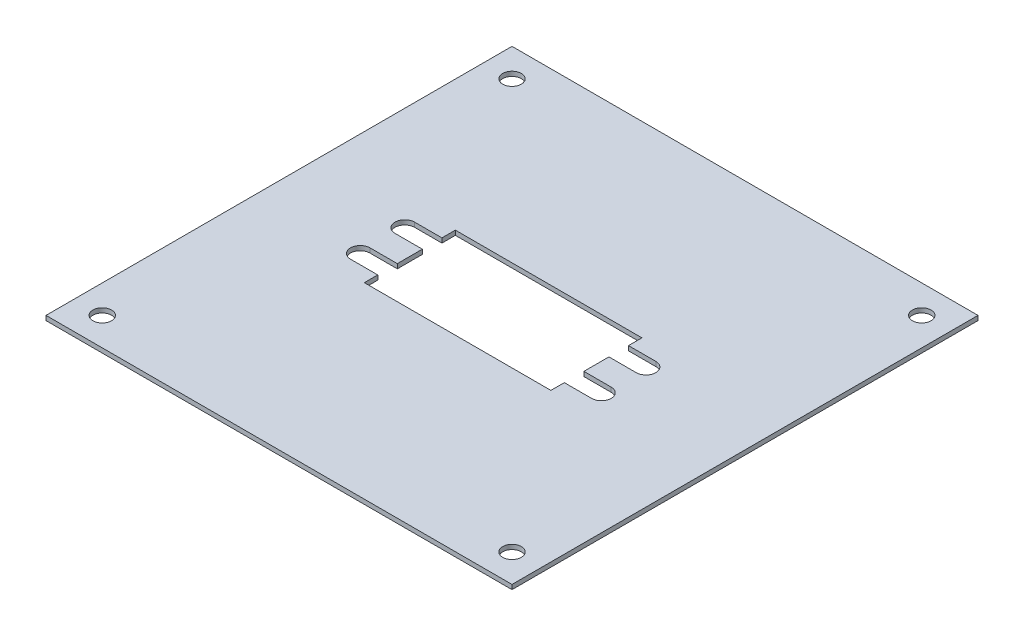
ISO-10303-21;
HEADER;
FILE_DESCRIPTION(('STEP AP214'),'2;1');
FILE_NAME('part.step','',(''),(''),'','','');
FILE_SCHEMA(('AUTOMOTIVE_DESIGN { 1 0 10303 214 1 1 1 1 }'));
ENDSEC;
DATA;
#1=APPLICATION_CONTEXT('core data for automotive mechanical design processes');
#2=APPLICATION_PROTOCOL_DEFINITION('international standard','automotive_design',2000,#1);
#3=PRODUCT_CONTEXT('',#1,'mechanical');
#4=PRODUCT('Part','Part','',(#3));
#5=PRODUCT_RELATED_PRODUCT_CATEGORY('part','',(#4));
#6=PRODUCT_DEFINITION_FORMATION('','',#4);
#7=PRODUCT_DEFINITION_CONTEXT('part definition',#1,'design');
#8=PRODUCT_DEFINITION('design','',#6,#7);
#9=PRODUCT_DEFINITION_SHAPE('','',#8);
#10=(LENGTH_UNIT() NAMED_UNIT(*) SI_UNIT(.MILLI.,.METRE.));
#11=(NAMED_UNIT(*) PLANE_ANGLE_UNIT() SI_UNIT($,.RADIAN.));
#12=(NAMED_UNIT(*) SI_UNIT($,.STERADIAN.) SOLID_ANGLE_UNIT());
#13=UNCERTAINTY_MEASURE_WITH_UNIT(LENGTH_MEASURE(1.E-05),#10,'distance_accuracy_value','');
#14=(GEOMETRIC_REPRESENTATION_CONTEXT(3) GLOBAL_UNCERTAINTY_ASSIGNED_CONTEXT((#13)) GLOBAL_UNIT_ASSIGNED_CONTEXT((#10,
#11,#12)) REPRESENTATION_CONTEXT('',''));
#15=CARTESIAN_POINT('',(0.,0.,0.));
#16=DIRECTION('',(0.,0.,1.));
#17=DIRECTION('',(1.,0.,0.));
#18=AXIS2_PLACEMENT_3D('',#15,#16,#17);
#19=CARTESIAN_POINT('',(18.55,-1.,9.99999999999999));
#20=DIRECTION('',(1.,0.,0.));
#21=DIRECTION('',(0.,0.,-1.));
#22=AXIS2_PLACEMENT_3D('',#19,#20,#21);
#23=PLANE('',#22);
#24=DIRECTION('',(0.,0.,-1.));
#25=VECTOR('',#24,1.);
#26=CARTESIAN_POINT('',(18.55,-1.,9.99999999999999));
#27=LINE('',#26,#25);
#28=CARTESIAN_POINT('',(18.55,-1.,2.75));
#29=VERTEX_POINT('',#28);
#30=CARTESIAN_POINT('',(18.55,-1.,-2.75));
#31=VERTEX_POINT('',#30);
#32=EDGE_CURVE('E62',#29,#31,#27,.T.);
#33=ORIENTED_EDGE('',*,*,#32,.F.);
#34=DIRECTION('',(0.,1.,0.));
#35=VECTOR('',#34,1.);
#36=CARTESIAN_POINT('',(18.55,-1.,2.75));
#37=LINE('',#36,#35);
#38=CARTESIAN_POINT('',(18.55,0.,2.75));
#39=VERTEX_POINT('',#38);
#40=EDGE_CURVE('E11',#29,#39,#37,.T.);
#41=ORIENTED_EDGE('',*,*,#40,.T.);
#42=DIRECTION('',(0.,0.,-1.));
#43=VECTOR('',#42,1.);
#44=CARTESIAN_POINT('',(18.55,0.,9.99999999999999));
#45=LINE('',#44,#43);
#46=CARTESIAN_POINT('',(18.55,0.,-2.75));
#47=VERTEX_POINT('',#46);
#48=EDGE_CURVE('E306',#39,#47,#45,.T.);
#49=ORIENTED_EDGE('',*,*,#48,.T.);
#50=DIRECTION('',(0.,-1.,0.));
#51=VECTOR('',#50,1.);
#52=CARTESIAN_POINT('',(18.55,-1.,-2.75));
#53=LINE('',#52,#51);
#54=EDGE_CURVE('E394',#47,#31,#53,.T.);
#55=ORIENTED_EDGE('',*,*,#54,.T.);
#56=EDGE_LOOP('',(#33,#41,#49,#55));
#57=FACE_BOUND('',#56,.T.);
#58=ADVANCED_FACE('F39',(#57),#23,.F.);
#59=CARTESIAN_POINT('',(18.55,-1.,-7.05));
#60=VERTEX_POINT('',#59);
#61=CARTESIAN_POINT('',(18.55,-1.,-10.));
#62=VERTEX_POINT('',#61);
#63=EDGE_CURVE('E291',#60,#62,#27,.T.);
#64=ORIENTED_EDGE('',*,*,#63,.F.);
#65=DIRECTION('',(0.,1.,0.));
#66=VECTOR('',#65,1.);
#67=CARTESIAN_POINT('',(18.55,-1.,-7.05));
#68=LINE('',#67,#66);
#69=CARTESIAN_POINT('',(18.55,0.,-7.05));
#70=VERTEX_POINT('',#69);
#71=EDGE_CURVE('E397',#60,#70,#68,.T.);
#72=ORIENTED_EDGE('',*,*,#71,.T.);
#73=CARTESIAN_POINT('',(18.55,0.,-10.));
#74=VERTEX_POINT('',#73);
#75=EDGE_CURVE('E286',#70,#74,#45,.T.);
#76=ORIENTED_EDGE('',*,*,#75,.T.);
#77=DIRECTION('',(0.,1.,0.));
#78=VECTOR('',#77,1.);
#79=CARTESIAN_POINT('',(18.55,-1.,-10.));
#80=LINE('',#79,#78);
#81=EDGE_CURVE('E302',#62,#74,#80,.T.);
#82=ORIENTED_EDGE('',*,*,#81,.F.);
#83=EDGE_LOOP('',(#64,#72,#76,#82));
#84=FACE_BOUND('',#83,.T.);
#85=ADVANCED_FACE('F466',(#84),#23,.F.);
#86=CARTESIAN_POINT('',(-22.45,-1.,9.99999999999999));
#87=DIRECTION('',(-1.,0.,0.));
#88=DIRECTION('',(0.,0.,1.));
#89=AXIS2_PLACEMENT_3D('',#86,#87,#88);
#90=PLANE('',#89);
#91=DIRECTION('',(0.,0.,1.));
#92=VECTOR('',#91,1.);
#93=CARTESIAN_POINT('',(-22.45,0.,9.99999999999999));
#94=LINE('',#93,#92);
#95=CARTESIAN_POINT('',(-22.45,0.,-2.75));
#96=VERTEX_POINT('',#95);
#97=CARTESIAN_POINT('',(-22.45,0.,2.75));
#98=VERTEX_POINT('',#97);
#99=EDGE_CURVE('E314',#96,#98,#94,.T.);
#100=ORIENTED_EDGE('',*,*,#99,.T.);
#101=DIRECTION('',(0.,-1.,0.));
#102=VECTOR('',#101,1.);
#103=CARTESIAN_POINT('',(-22.45,-1.,2.75));
#104=LINE('',#103,#102);
#105=CARTESIAN_POINT('',(-22.45,-1.,2.75));
#106=VERTEX_POINT('',#105);
#107=EDGE_CURVE('E391',#98,#106,#104,.T.);
#108=ORIENTED_EDGE('',*,*,#107,.T.);
#109=DIRECTION('',(0.,0.,1.));
#110=VECTOR('',#109,1.);
#111=CARTESIAN_POINT('',(-22.45,-1.,9.99999999999999));
#112=LINE('',#111,#110);
#113=CARTESIAN_POINT('',(-22.45,-1.,-2.75));
#114=VERTEX_POINT('',#113);
#115=EDGE_CURVE('E299',#114,#106,#112,.T.);
#116=ORIENTED_EDGE('',*,*,#115,.F.);
#117=DIRECTION('',(0.,1.,0.));
#118=VECTOR('',#117,1.);
#119=CARTESIAN_POINT('',(-22.45,-1.,-2.75));
#120=LINE('',#119,#118);
#121=EDGE_CURVE('E377',#114,#96,#120,.T.);
#122=ORIENTED_EDGE('',*,*,#121,.T.);
#123=EDGE_LOOP('',(#100,#108,#116,#122));
#124=FACE_BOUND('',#123,.T.);
#125=ADVANCED_FACE('F418',(#124),#90,.F.);
#126=CARTESIAN_POINT('',(-22.45,0.,-10.));
#127=VERTEX_POINT('',#126);
#128=CARTESIAN_POINT('',(-22.45,0.,-7.05));
#129=VERTEX_POINT('',#128);
#130=EDGE_CURVE('E310',#127,#129,#94,.T.);
#131=ORIENTED_EDGE('',*,*,#130,.T.);
#132=DIRECTION('',(0.,-1.,0.));
#133=VECTOR('',#132,1.);
#134=CARTESIAN_POINT('',(-22.45,-1.,-7.05));
#135=LINE('',#134,#133);
#136=CARTESIAN_POINT('',(-22.45,-1.,-7.05));
#137=VERTEX_POINT('',#136);
#138=EDGE_CURVE('E385',#129,#137,#135,.T.);
#139=ORIENTED_EDGE('',*,*,#138,.T.);
#140=CARTESIAN_POINT('',(-22.45,-1.,-10.));
#141=VERTEX_POINT('',#140);
#142=EDGE_CURVE('E295',#141,#137,#112,.T.);
#143=ORIENTED_EDGE('',*,*,#142,.F.);
#144=DIRECTION('',(0.,1.,0.));
#145=VECTOR('',#144,1.);
#146=CARTESIAN_POINT('',(-22.45,-1.,-10.));
#147=LINE('',#146,#145);
#148=EDGE_CURVE('E323',#141,#127,#147,.T.);
#149=ORIENTED_EDGE('',*,*,#148,.T.);
#150=EDGE_LOOP('',(#131,#139,#143,#149));
#151=FACE_BOUND('',#150,.T.);
#152=ADVANCED_FACE('F443',(#151),#90,.F.);
#153=CARTESIAN_POINT('',(51.2,-1.,51.2));
#154=DIRECTION('',(1.,0.,0.));
#155=DIRECTION('',(0.,0.,-1.));
#156=AXIS2_PLACEMENT_3D('',#153,#154,#155);
#157=PLANE('',#156);
#158=DIRECTION('',(0.,0.,-1.));
#159=VECTOR('',#158,1.);
#160=CARTESIAN_POINT('',(51.2,0.,51.2));
#161=LINE('',#160,#159);
#162=CARTESIAN_POINT('',(51.2,0.,51.2));
#163=VERTEX_POINT('',#162);
#164=CARTESIAN_POINT('',(51.2,0.,-51.2));
#165=VERTEX_POINT('',#164);
#166=EDGE_CURVE('E348',#163,#165,#161,.T.);
#167=ORIENTED_EDGE('',*,*,#166,.F.);
#168=DIRECTION('',(0.,1.,0.));
#169=VECTOR('',#168,1.);
#170=CARTESIAN_POINT('',(51.2,-1.,51.2));
#171=LINE('',#170,#169);
#172=CARTESIAN_POINT('',(51.2,-1.,51.2));
#173=VERTEX_POINT('',#172);
#174=EDGE_CURVE('E375',#173,#163,#171,.T.);
#175=ORIENTED_EDGE('',*,*,#174,.F.);
#176=DIRECTION('',(0.,0.,-1.));
#177=VECTOR('',#176,1.);
#178=CARTESIAN_POINT('',(51.2,-1.,51.2));
#179=LINE('',#178,#177);
#180=CARTESIAN_POINT('',(51.2,-1.,-51.2));
#181=VERTEX_POINT('',#180);
#182=EDGE_CURVE('E351',#173,#181,#179,.T.);
#183=ORIENTED_EDGE('',*,*,#182,.T.);
#184=DIRECTION('',(0.,1.,0.));
#185=VECTOR('',#184,1.);
#186=CARTESIAN_POINT('',(51.2,-1.,-51.2));
#187=LINE('',#186,#185);
#188=EDGE_CURVE('E364',#181,#165,#187,.T.);
#189=ORIENTED_EDGE('',*,*,#188,.T.);
#190=EDGE_LOOP('',(#167,#175,#183,#189));
#191=FACE_BOUND('',#190,.T.);
#192=ADVANCED_FACE('F41',(#191),#157,.T.);
#193=CARTESIAN_POINT('',(-51.2,-1.,51.2));
#194=DIRECTION('',(0.,0.,1.));
#195=DIRECTION('',(1.,0.,0.));
#196=AXIS2_PLACEMENT_3D('',#193,#194,#195);
#197=PLANE('',#196);
#198=DIRECTION('',(1.,0.,0.));
#199=VECTOR('',#198,1.);
#200=CARTESIAN_POINT('',(-51.2,0.,51.2));
#201=LINE('',#200,#199);
#202=CARTESIAN_POINT('',(-51.2,0.,51.2));
#203=VERTEX_POINT('',#202);
#204=EDGE_CURVE('E355',#203,#163,#201,.T.);
#205=ORIENTED_EDGE('',*,*,#204,.F.);
#206=DIRECTION('',(0.,1.,0.));
#207=VECTOR('',#206,1.);
#208=CARTESIAN_POINT('',(-51.2,-1.,51.2));
#209=LINE('',#208,#207);
#210=CARTESIAN_POINT('',(-51.2,-1.,51.2));
#211=VERTEX_POINT('',#210);
#212=EDGE_CURVE('E378',#211,#203,#209,.T.);
#213=ORIENTED_EDGE('',*,*,#212,.F.);
#214=DIRECTION('',(1.,0.,0.));
#215=VECTOR('',#214,1.);
#216=CARTESIAN_POINT('',(-51.2,-1.,51.2));
#217=LINE('',#216,#215);
#218=EDGE_CURVE('E361',#211,#173,#217,.T.);
#219=ORIENTED_EDGE('',*,*,#218,.T.);
#220=ORIENTED_EDGE('',*,*,#174,.T.);
#221=EDGE_LOOP('',(#205,#213,#219,#220));
#222=FACE_BOUND('',#221,.T.);
#223=ADVANCED_FACE('F516',(#222),#197,.T.);
#224=CARTESIAN_POINT('',(-51.2,-1.,51.2));
#225=DIRECTION('',(-1.,0.,0.));
#226=DIRECTION('',(0.,0.,1.));
#227=AXIS2_PLACEMENT_3D('',#224,#225,#226);
#228=PLANE('',#227);
#229=DIRECTION('',(0.,0.,1.));
#230=VECTOR('',#229,1.);
#231=CARTESIAN_POINT('',(-51.2,0.,51.2));
#232=LINE('',#231,#230);
#233=CARTESIAN_POINT('',(-51.2,0.,-51.2));
#234=VERTEX_POINT('',#233);
#235=EDGE_CURVE('E370',#234,#203,#232,.T.);
#236=ORIENTED_EDGE('',*,*,#235,.F.);
#237=DIRECTION('',(0.,1.,0.));
#238=VECTOR('',#237,1.);
#239=CARTESIAN_POINT('',(-51.2,-1.,-51.2));
#240=LINE('',#239,#238);
#241=CARTESIAN_POINT('',(-51.2,-1.,-51.2));
#242=VERTEX_POINT('',#241);
#243=EDGE_CURVE('E380',#242,#234,#240,.T.);
#244=ORIENTED_EDGE('',*,*,#243,.F.);
#245=DIRECTION('',(0.,0.,1.));
#246=VECTOR('',#245,1.);
#247=CARTESIAN_POINT('',(-51.2,-1.,51.2));
#248=LINE('',#247,#246);
#249=EDGE_CURVE('E358',#242,#211,#248,.T.);
#250=ORIENTED_EDGE('',*,*,#249,.T.);
#251=ORIENTED_EDGE('',*,*,#212,.T.);
#252=EDGE_LOOP('',(#236,#244,#250,#251));
#253=FACE_BOUND('',#252,.T.);
#254=ADVANCED_FACE('F519',(#253),#228,.T.);
#255=CARTESIAN_POINT('',(-51.2,-1.,-51.2));
#256=DIRECTION('',(0.,0.,-1.));
#257=DIRECTION('',(-1.,0.,0.));
#258=AXIS2_PLACEMENT_3D('',#255,#256,#257);
#259=PLANE('',#258);
#260=DIRECTION('',(-1.,0.,0.));
#261=VECTOR('',#260,1.);
#262=CARTESIAN_POINT('',(-51.2,0.,-51.2));
#263=LINE('',#262,#261);
#264=EDGE_CURVE('E367',#165,#234,#263,.T.);
#265=ORIENTED_EDGE('',*,*,#264,.F.);
#266=ORIENTED_EDGE('',*,*,#188,.F.);
#267=DIRECTION('',(-1.,0.,0.));
#268=VECTOR('',#267,1.);
#269=CARTESIAN_POINT('',(-51.2,-1.,-51.2));
#270=LINE('',#269,#268);
#271=EDGE_CURVE('E354',#181,#242,#270,.T.);
#272=ORIENTED_EDGE('',*,*,#271,.T.);
#273=ORIENTED_EDGE('',*,*,#243,.T.);
#274=EDGE_LOOP('',(#265,#266,#272,#273));
#275=FACE_BOUND('',#274,.T.);
#276=ADVANCED_FACE('F513',(#275),#259,.T.);
#277=CARTESIAN_POINT('',(0.,-1.,0.));
#278=DIRECTION('',(0.,-1.,0.));
#279=DIRECTION('',(0.,0.,-1.));
#280=AXIS2_PLACEMENT_3D('',#277,#278,#279);
#281=PLANE('',#280);
#282=DIRECTION('',(1.,0.,0.));
#283=VECTOR('',#282,1.);
#284=CARTESIAN_POINT('',(0.,-1.,2.75));
#285=LINE('',#284,#283);
#286=CARTESIAN_POINT('',(24.55,-0.999999999999999,2.75));
#287=VERTEX_POINT('',#286);
#288=EDGE_CURVE('E229',#29,#287,#285,.T.);
#289=ORIENTED_EDGE('',*,*,#288,.F.);
#290=ORIENTED_EDGE('',*,*,#32,.T.);
#291=DIRECTION('',(-1.,0.,0.));
#292=VECTOR('',#291,1.);
#293=CARTESIAN_POINT('',(0.,-1.,-2.75));
#294=LINE('',#293,#292);
#295=CARTESIAN_POINT('',(24.55,-0.999999999999999,-2.75));
#296=VERTEX_POINT('',#295);
#297=EDGE_CURVE('E243',#296,#31,#294,.T.);
#298=ORIENTED_EDGE('',*,*,#297,.F.);
#299=CARTESIAN_POINT('',(24.55,-0.999999999999999,-4.9));
#300=DIRECTION('',(0.,-1.,0.));
#301=DIRECTION('',(0.,0.,-1.));
#302=AXIS2_PLACEMENT_3D('',#299,#300,#301);
#303=CIRCLE('',#302,2.15);
#304=CARTESIAN_POINT('',(24.55,-0.999999999999999,-7.05));
#305=VERTEX_POINT('',#304);
#306=EDGE_CURVE('E248',#305,#296,#303,.T.);
#307=ORIENTED_EDGE('',*,*,#306,.F.);
#308=DIRECTION('',(1.,0.,0.));
#309=VECTOR('',#308,1.);
#310=CARTESIAN_POINT('',(0.,-1.,-7.05));
#311=LINE('',#310,#309);
#312=EDGE_CURVE('E246',#60,#305,#311,.T.);
#313=ORIENTED_EDGE('',*,*,#312,.F.);
#314=ORIENTED_EDGE('',*,*,#63,.T.);
#315=DIRECTION('',(-1.,0.,0.));
#316=VECTOR('',#315,1.);
#317=CARTESIAN_POINT('',(-22.45,-1.,-10.));
#318=LINE('',#317,#316);
#319=EDGE_CURVE('E290',#62,#141,#318,.T.);
#320=ORIENTED_EDGE('',*,*,#319,.T.);
#321=ORIENTED_EDGE('',*,*,#142,.T.);
#322=DIRECTION('',(1.,0.,0.));
#323=VECTOR('',#322,1.);
#324=CARTESIAN_POINT('',(0.,-1.,-7.05));
#325=LINE('',#324,#323);
#326=CARTESIAN_POINT('',(-28.45,-0.999999999999999,-7.05));
#327=VERTEX_POINT('',#326);
#328=EDGE_CURVE('E282',#327,#137,#325,.T.);
#329=ORIENTED_EDGE('',*,*,#328,.F.);
#330=CARTESIAN_POINT('',(-28.45,-0.999999999999999,-4.9));
#331=DIRECTION('',(0.,-1.,0.));
#332=DIRECTION('',(0.,0.,-1.));
#333=AXIS2_PLACEMENT_3D('',#330,#331,#332);
#334=CIRCLE('',#333,2.15);
#335=CARTESIAN_POINT('',(-28.45,-0.999999999999999,-2.75));
#336=VERTEX_POINT('',#335);
#337=EDGE_CURVE('E284',#336,#327,#334,.T.);
#338=ORIENTED_EDGE('',*,*,#337,.F.);
#339=DIRECTION('',(-1.,0.,0.));
#340=VECTOR('',#339,1.);
#341=CARTESIAN_POINT('',(0.,-1.,-2.75));
#342=LINE('',#341,#340);
#343=EDGE_CURVE('E279',#114,#336,#342,.T.);
#344=ORIENTED_EDGE('',*,*,#343,.F.);
#345=ORIENTED_EDGE('',*,*,#115,.T.);
#346=DIRECTION('',(1.,0.,0.));
#347=VECTOR('',#346,1.);
#348=CARTESIAN_POINT('',(0.,-1.,2.75));
#349=LINE('',#348,#347);
#350=CARTESIAN_POINT('',(-28.45,-0.999999999999999,2.75));
#351=VERTEX_POINT('',#350);
#352=EDGE_CURVE('E264',#351,#106,#349,.T.);
#353=ORIENTED_EDGE('',*,*,#352,.F.);
#354=CARTESIAN_POINT('',(-28.45,-0.999999999999999,4.9));
#355=DIRECTION('',(0.,-1.,0.));
#356=DIRECTION('',(0.,0.,-1.));
#357=AXIS2_PLACEMENT_3D('',#354,#355,#356);
#358=CIRCLE('',#357,2.15);
#359=CARTESIAN_POINT('',(-28.45,-0.999999999999999,7.05));
#360=VERTEX_POINT('',#359);
#361=EDGE_CURVE('E266',#360,#351,#358,.T.);
#362=ORIENTED_EDGE('',*,*,#361,.F.);
#363=DIRECTION('',(-1.,0.,0.));
#364=VECTOR('',#363,1.);
#365=CARTESIAN_POINT('',(0.,-1.,7.05));
#366=LINE('',#365,#364);
#367=CARTESIAN_POINT('',(-22.45,-1.,7.05));
#368=VERTEX_POINT('',#367);
#369=EDGE_CURVE('E261',#368,#360,#366,.T.);
#370=ORIENTED_EDGE('',*,*,#369,.F.);
#371=CARTESIAN_POINT('',(-22.45,-1.,9.99999999999999));
#372=VERTEX_POINT('',#371);
#373=EDGE_CURVE('E294',#368,#372,#112,.T.);
#374=ORIENTED_EDGE('',*,*,#373,.T.);
#375=DIRECTION('',(1.,0.,0.));
#376=VECTOR('',#375,1.);
#377=CARTESIAN_POINT('',(-22.45,-1.,9.99999999999999));
#378=LINE('',#377,#376);
#379=CARTESIAN_POINT('',(18.55,-1.,9.99999999999999));
#380=VERTEX_POINT('',#379);
#381=EDGE_CURVE('E298',#372,#380,#378,.T.);
#382=ORIENTED_EDGE('',*,*,#381,.T.);
#383=CARTESIAN_POINT('',(18.55,-1.,7.05));
#384=VERTEX_POINT('',#383);
#385=EDGE_CURVE('E287',#380,#384,#27,.T.);
#386=ORIENTED_EDGE('',*,*,#385,.T.);
#387=DIRECTION('',(-1.,0.,0.));
#388=VECTOR('',#387,1.);
#389=CARTESIAN_POINT('',(0.,-1.,7.05));
#390=LINE('',#389,#388);
#391=CARTESIAN_POINT('',(24.55,-0.999999999999999,7.05));
#392=VERTEX_POINT('',#391);
#393=EDGE_CURVE('E54',#392,#384,#390,.T.);
#394=ORIENTED_EDGE('',*,*,#393,.F.);
#395=CARTESIAN_POINT('',(24.55,-0.999999999999999,4.9));
#396=DIRECTION('',(0.,-1.,0.));
#397=DIRECTION('',(0.,0.,-1.));
#398=AXIS2_PLACEMENT_3D('',#395,#396,#397);
#399=CIRCLE('',#398,2.15);
#400=EDGE_CURVE('E210',#287,#392,#399,.T.);
#401=ORIENTED_EDGE('',*,*,#400,.F.);
#402=EDGE_LOOP('',(#289,#290,#298,#307,#313,#314,#320,#321,#329,#338,#344,#345,#353,#362,#370,
#374,#382,#386,#394,#401));
#403=FACE_BOUND('',#402,.T.);
#404=CARTESIAN_POINT('',(-45.02,-1.,-45.02));
#405=DIRECTION('',(0.,1.,0.));
#406=DIRECTION('',(0.,0.,1.));
#407=AXIS2_PLACEMENT_3D('',#404,#405,#406);
#408=CIRCLE('',#407,2.05);
#409=CARTESIAN_POINT('',(-45.02,-1.,-42.97));
#410=VERTEX_POINT('',#409);
#411=EDGE_CURVE('E327',#410,#410,#408,.T.);
#412=ORIENTED_EDGE('',*,*,#411,.T.);
#413=EDGE_LOOP('',(#412));
#414=FACE_BOUND('',#413,.T.);
#415=CARTESIAN_POINT('',(-45.02,-1.,45.02));
#416=DIRECTION('',(0.,1.,0.));
#417=DIRECTION('',(0.,0.,1.));
#418=AXIS2_PLACEMENT_3D('',#415,#416,#417);
#419=CIRCLE('',#418,2.05);
#420=CARTESIAN_POINT('',(-45.02,-1.,47.07));
#421=VERTEX_POINT('',#420);
#422=EDGE_CURVE('E333',#421,#421,#419,.T.);
#423=ORIENTED_EDGE('',*,*,#422,.T.);
#424=EDGE_LOOP('',(#423));
#425=FACE_BOUND('',#424,.T.);
#426=CARTESIAN_POINT('',(45.02,-1.,45.02));
#427=DIRECTION('',(0.,1.,0.));
#428=DIRECTION('',(0.,0.,1.));
#429=AXIS2_PLACEMENT_3D('',#426,#427,#428);
#430=CIRCLE('',#429,2.04999999999999);
#431=CARTESIAN_POINT('',(45.02,-1.,47.07));
#432=VERTEX_POINT('',#431);
#433=EDGE_CURVE('E339',#432,#432,#430,.T.);
#434=ORIENTED_EDGE('',*,*,#433,.T.);
#435=EDGE_LOOP('',(#434));
#436=FACE_BOUND('',#435,.T.);
#437=CARTESIAN_POINT('',(45.02,-1.,-45.02));
#438=DIRECTION('',(0.,1.,0.));
#439=DIRECTION('',(0.,0.,1.));
#440=AXIS2_PLACEMENT_3D('',#437,#438,#439);
#441=CIRCLE('',#440,2.04999999999999);
#442=CARTESIAN_POINT('',(45.02,-1.,-42.97));
#443=VERTEX_POINT('',#442);
#444=EDGE_CURVE('E345',#443,#443,#441,.T.);
#445=ORIENTED_EDGE('',*,*,#444,.T.);
#446=EDGE_LOOP('',(#445));
#447=FACE_BOUND('',#446,.T.);
#448=ORIENTED_EDGE('',*,*,#182,.F.);
#449=ORIENTED_EDGE('',*,*,#218,.F.);
#450=ORIENTED_EDGE('',*,*,#249,.F.);
#451=ORIENTED_EDGE('',*,*,#271,.F.);
#452=EDGE_LOOP('',(#448,#449,#450,#451));
#453=FACE_BOUND('',#452,.T.);
#454=ADVANCED_FACE('F402',(#403,#414,#425,#436,#447,#453),#281,.T.);
#455=CARTESIAN_POINT('',(0.,0.,0.));
#456=DIRECTION('',(0.,-1.,0.));
#457=DIRECTION('',(0.,0.,-1.));
#458=AXIS2_PLACEMENT_3D('',#455,#456,#457);
#459=PLANE('',#458);
#460=ORIENTED_EDGE('',*,*,#48,.F.);
#461=DIRECTION('',(-1.,0.,0.));
#462=VECTOR('',#461,1.);
#463=CARTESIAN_POINT('',(12.55,0.,2.75));
#464=LINE('',#463,#462);
#465=CARTESIAN_POINT('',(24.55,0.,2.75));
#466=VERTEX_POINT('',#465);
#467=EDGE_CURVE('E212',#466,#39,#464,.T.);
#468=ORIENTED_EDGE('',*,*,#467,.F.);
#469=CARTESIAN_POINT('',(24.55,0.,4.9));
#470=DIRECTION('',(0.,1.,0.));
#471=DIRECTION('',(0.,0.,1.));
#472=AXIS2_PLACEMENT_3D('',#469,#470,#471);
#473=CIRCLE('',#472,2.15);
#474=CARTESIAN_POINT('',(24.55,0.,7.05));
#475=VERTEX_POINT('',#474);
#476=EDGE_CURVE('E207',#475,#466,#473,.T.);
#477=ORIENTED_EDGE('',*,*,#476,.F.);
#478=DIRECTION('',(1.,0.,0.));
#479=VECTOR('',#478,1.);
#480=CARTESIAN_POINT('',(12.55,0.,7.05));
#481=LINE('',#480,#479);
#482=CARTESIAN_POINT('',(18.55,0.,7.05));
#483=VERTEX_POINT('',#482);
#484=EDGE_CURVE('E215',#483,#475,#481,.T.);
#485=ORIENTED_EDGE('',*,*,#484,.F.);
#486=CARTESIAN_POINT('',(18.55,0.,9.99999999999999));
#487=VERTEX_POINT('',#486);
#488=EDGE_CURVE('E303',#487,#483,#45,.T.);
#489=ORIENTED_EDGE('',*,*,#488,.F.);
#490=DIRECTION('',(1.,0.,0.));
#491=VECTOR('',#490,1.);
#492=CARTESIAN_POINT('',(-22.45,0.,9.99999999999999));
#493=LINE('',#492,#491);
#494=CARTESIAN_POINT('',(-22.45,0.,9.99999999999999));
#495=VERTEX_POINT('',#494);
#496=EDGE_CURVE('E313',#495,#487,#493,.T.);
#497=ORIENTED_EDGE('',*,*,#496,.F.);
#498=CARTESIAN_POINT('',(-22.45,0.,7.05));
#499=VERTEX_POINT('',#498);
#500=EDGE_CURVE('E309',#499,#495,#94,.T.);
#501=ORIENTED_EDGE('',*,*,#500,.F.);
#502=DIRECTION('',(1.,0.,0.));
#503=VECTOR('',#502,1.);
#504=CARTESIAN_POINT('',(-28.45,0.,7.05));
#505=LINE('',#504,#503);
#506=CARTESIAN_POINT('',(-28.45,0.,7.05));
#507=VERTEX_POINT('',#506);
#508=EDGE_CURVE('E253',#507,#499,#505,.T.);
#509=ORIENTED_EDGE('',*,*,#508,.F.);
#510=CARTESIAN_POINT('',(-28.45,0.,4.9));
#511=DIRECTION('',(0.,1.,0.));
#512=DIRECTION('',(0.,0.,1.));
#513=AXIS2_PLACEMENT_3D('',#510,#511,#512);
#514=CIRCLE('',#513,2.15);
#515=CARTESIAN_POINT('',(-28.45,0.,2.75));
#516=VERTEX_POINT('',#515);
#517=EDGE_CURVE('E250',#516,#507,#514,.T.);
#518=ORIENTED_EDGE('',*,*,#517,.F.);
#519=DIRECTION('',(-1.,0.,0.));
#520=VECTOR('',#519,1.);
#521=CARTESIAN_POINT('',(-28.45,0.,2.75));
#522=LINE('',#521,#520);
#523=EDGE_CURVE('E255',#98,#516,#522,.T.);
#524=ORIENTED_EDGE('',*,*,#523,.F.);
#525=ORIENTED_EDGE('',*,*,#99,.F.);
#526=DIRECTION('',(1.,0.,0.));
#527=VECTOR('',#526,1.);
#528=CARTESIAN_POINT('',(-28.45,0.,-2.75));
#529=LINE('',#528,#527);
#530=CARTESIAN_POINT('',(-28.45,0.,-2.75));
#531=VERTEX_POINT('',#530);
#532=EDGE_CURVE('E271',#531,#96,#529,.T.);
#533=ORIENTED_EDGE('',*,*,#532,.F.);
#534=CARTESIAN_POINT('',(-28.45,0.,-4.9));
#535=DIRECTION('',(0.,1.,0.));
#536=DIRECTION('',(0.,0.,1.));
#537=AXIS2_PLACEMENT_3D('',#534,#535,#536);
#538=CIRCLE('',#537,2.15);
#539=CARTESIAN_POINT('',(-28.45,0.,-7.05));
#540=VERTEX_POINT('',#539);
#541=EDGE_CURVE('E268',#540,#531,#538,.T.);
#542=ORIENTED_EDGE('',*,*,#541,.F.);
#543=DIRECTION('',(-1.,0.,0.));
#544=VECTOR('',#543,1.);
#545=CARTESIAN_POINT('',(-28.45,0.,-7.05));
#546=LINE('',#545,#544);
#547=EDGE_CURVE('E273',#129,#540,#546,.T.);
#548=ORIENTED_EDGE('',*,*,#547,.F.);
#549=ORIENTED_EDGE('',*,*,#130,.F.);
#550=DIRECTION('',(-1.,0.,0.));
#551=VECTOR('',#550,1.);
#552=CARTESIAN_POINT('',(-22.45,0.,-10.));
#553=LINE('',#552,#551);
#554=EDGE_CURVE('E305',#74,#127,#553,.T.);
#555=ORIENTED_EDGE('',*,*,#554,.F.);
#556=ORIENTED_EDGE('',*,*,#75,.F.);
#557=DIRECTION('',(-1.,0.,0.));
#558=VECTOR('',#557,1.);
#559=CARTESIAN_POINT('',(12.55,0.,-7.05));
#560=LINE('',#559,#558);
#561=CARTESIAN_POINT('',(24.55,0.,-7.05));
#562=VERTEX_POINT('',#561);
#563=EDGE_CURVE('E238',#562,#70,#560,.T.);
#564=ORIENTED_EDGE('',*,*,#563,.F.);
#565=CARTESIAN_POINT('',(24.55,0.,-4.9));
#566=DIRECTION('',(0.,1.,0.));
#567=DIRECTION('',(0.,0.,1.));
#568=AXIS2_PLACEMENT_3D('',#565,#566,#567);
#569=CIRCLE('',#568,2.15);
#570=CARTESIAN_POINT('',(24.55,0.,-2.75));
#571=VERTEX_POINT('',#570);
#572=EDGE_CURVE('E235',#571,#562,#569,.T.);
#573=ORIENTED_EDGE('',*,*,#572,.F.);
#574=DIRECTION('',(1.,0.,0.));
#575=VECTOR('',#574,1.);
#576=CARTESIAN_POINT('',(12.55,0.,-2.75));
#577=LINE('',#576,#575);
#578=EDGE_CURVE('E232',#47,#571,#577,.T.);
#579=ORIENTED_EDGE('',*,*,#578,.F.);
#580=EDGE_LOOP('',(#460,#468,#477,#485,#489,#497,#501,#509,#518,#524,#525,#533,#542,#548,#549,
#555,#556,#564,#573,#579));
#581=FACE_BOUND('',#580,.T.);
#582=CARTESIAN_POINT('',(-45.02,0.,-45.02));
#583=DIRECTION('',(0.,1.,0.));
#584=DIRECTION('',(0.,0.,1.));
#585=AXIS2_PLACEMENT_3D('',#582,#583,#584);
#586=CIRCLE('',#585,2.05);
#587=CARTESIAN_POINT('',(-45.02,0.,-42.97));
#588=VERTEX_POINT('',#587);
#589=EDGE_CURVE('E319',#588,#588,#586,.T.);
#590=ORIENTED_EDGE('',*,*,#589,.F.);
#591=EDGE_LOOP('',(#590));
#592=FACE_BOUND('',#591,.T.);
#593=CARTESIAN_POINT('',(-45.02,0.,45.02));
#594=DIRECTION('',(0.,1.,0.));
#595=DIRECTION('',(0.,0.,1.));
#596=AXIS2_PLACEMENT_3D('',#593,#594,#595);
#597=CIRCLE('',#596,2.05);
#598=CARTESIAN_POINT('',(-45.02,0.,47.07));
#599=VERTEX_POINT('',#598);
#600=EDGE_CURVE('E330',#599,#599,#597,.T.);
#601=ORIENTED_EDGE('',*,*,#600,.F.);
#602=EDGE_LOOP('',(#601));
#603=FACE_BOUND('',#602,.T.);
#604=CARTESIAN_POINT('',(45.02,0.,45.02));
#605=DIRECTION('',(0.,1.,0.));
#606=DIRECTION('',(0.,0.,1.));
#607=AXIS2_PLACEMENT_3D('',#604,#605,#606);
#608=CIRCLE('',#607,2.04999999999999);
#609=CARTESIAN_POINT('',(45.02,0.,47.07));
#610=VERTEX_POINT('',#609);
#611=EDGE_CURVE('E336',#610,#610,#608,.T.);
#612=ORIENTED_EDGE('',*,*,#611,.F.);
#613=EDGE_LOOP('',(#612));
#614=FACE_BOUND('',#613,.T.);
#615=CARTESIAN_POINT('',(45.02,0.,-45.02));
#616=DIRECTION('',(0.,1.,0.));
#617=DIRECTION('',(0.,0.,1.));
#618=AXIS2_PLACEMENT_3D('',#615,#616,#617);
#619=CIRCLE('',#618,2.04999999999999);
#620=CARTESIAN_POINT('',(45.02,0.,-42.97));
#621=VERTEX_POINT('',#620);
#622=EDGE_CURVE('E342',#621,#621,#619,.T.);
#623=ORIENTED_EDGE('',*,*,#622,.F.);
#624=EDGE_LOOP('',(#623));
#625=FACE_BOUND('',#624,.T.);
#626=ORIENTED_EDGE('',*,*,#166,.T.);
#627=ORIENTED_EDGE('',*,*,#264,.T.);
#628=ORIENTED_EDGE('',*,*,#235,.T.);
#629=ORIENTED_EDGE('',*,*,#204,.T.);
#630=EDGE_LOOP('',(#626,#627,#628,#629));
#631=FACE_BOUND('',#630,.T.);
#632=ADVANCED_FACE('F222',(#581,#592,#603,#614,#625,#631),#459,.F.);
#633=CARTESIAN_POINT('',(45.02,-1.,-45.02));
#634=DIRECTION('',(0.,1.,0.));
#635=DIRECTION('',(0.,0.,1.));
#636=AXIS2_PLACEMENT_3D('',#633,#634,#635);
#637=CYLINDRICAL_SURFACE('',#636,2.04999999999999);
#638=ORIENTED_EDGE('',*,*,#444,.F.);
#639=EDGE_LOOP('',(#638));
#640=FACE_BOUND('',#639,.T.);
#641=ORIENTED_EDGE('',*,*,#622,.T.);
#642=EDGE_LOOP('',(#641));
#643=FACE_BOUND('',#642,.T.);
#644=ADVANCED_FACE('F506',(#640,#643),#637,.F.);
#645=CARTESIAN_POINT('',(45.02,-1.,45.02));
#646=DIRECTION('',(0.,1.,0.));
#647=DIRECTION('',(0.,0.,1.));
#648=AXIS2_PLACEMENT_3D('',#645,#646,#647);
#649=CYLINDRICAL_SURFACE('',#648,2.04999999999999);
#650=ORIENTED_EDGE('',*,*,#433,.F.);
#651=EDGE_LOOP('',(#650));
#652=FACE_BOUND('',#651,.T.);
#653=ORIENTED_EDGE('',*,*,#611,.T.);
#654=EDGE_LOOP('',(#653));
#655=FACE_BOUND('',#654,.T.);
#656=ADVANCED_FACE('F498',(#652,#655),#649,.F.);
#657=CARTESIAN_POINT('',(-45.02,-1.,45.02));
#658=DIRECTION('',(0.,1.,0.));
#659=DIRECTION('',(0.,0.,1.));
#660=AXIS2_PLACEMENT_3D('',#657,#658,#659);
#661=CYLINDRICAL_SURFACE('',#660,2.05);
#662=ORIENTED_EDGE('',*,*,#422,.F.);
#663=EDGE_LOOP('',(#662));
#664=FACE_BOUND('',#663,.T.);
#665=ORIENTED_EDGE('',*,*,#600,.T.);
#666=EDGE_LOOP('',(#665));
#667=FACE_BOUND('',#666,.T.);
#668=ADVANCED_FACE('F493',(#664,#667),#661,.F.);
#669=CARTESIAN_POINT('',(-45.02,-1.,-45.02));
#670=DIRECTION('',(0.,1.,0.));
#671=DIRECTION('',(0.,0.,1.));
#672=AXIS2_PLACEMENT_3D('',#669,#670,#671);
#673=CYLINDRICAL_SURFACE('',#672,2.05);
#674=ORIENTED_EDGE('',*,*,#411,.F.);
#675=EDGE_LOOP('',(#674));
#676=FACE_BOUND('',#675,.T.);
#677=ORIENTED_EDGE('',*,*,#589,.T.);
#678=EDGE_LOOP('',(#677));
#679=FACE_BOUND('',#678,.T.);
#680=ADVANCED_FACE('F486',(#676,#679),#673,.F.);
#681=ORIENTED_EDGE('',*,*,#488,.T.);
#682=DIRECTION('',(0.,-1.,0.));
#683=VECTOR('',#682,1.);
#684=CARTESIAN_POINT('',(18.55,-1.,7.05));
#685=LINE('',#684,#683);
#686=EDGE_CURVE('E47',#483,#384,#685,.T.);
#687=ORIENTED_EDGE('',*,*,#686,.T.);
#688=ORIENTED_EDGE('',*,*,#385,.F.);
#689=DIRECTION('',(0.,1.,0.));
#690=VECTOR('',#689,1.);
#691=CARTESIAN_POINT('',(18.55,-1.,9.99999999999999));
#692=LINE('',#691,#690);
#693=EDGE_CURVE('E317',#380,#487,#692,.T.);
#694=ORIENTED_EDGE('',*,*,#693,.T.);
#695=EDGE_LOOP('',(#681,#687,#688,#694));
#696=FACE_BOUND('',#695,.T.);
#697=ADVANCED_FACE('F401',(#696),#23,.F.);
#698=CARTESIAN_POINT('',(-22.45,-1.,9.99999999999999));
#699=DIRECTION('',(0.,0.,1.));
#700=DIRECTION('',(1.,0.,0.));
#701=AXIS2_PLACEMENT_3D('',#698,#699,#700);
#702=PLANE('',#701);
#703=ORIENTED_EDGE('',*,*,#496,.T.);
#704=ORIENTED_EDGE('',*,*,#693,.F.);
#705=ORIENTED_EDGE('',*,*,#381,.F.);
#706=DIRECTION('',(0.,1.,0.));
#707=VECTOR('',#706,1.);
#708=CARTESIAN_POINT('',(-22.45,-1.,9.99999999999999));
#709=LINE('',#708,#707);
#710=EDGE_CURVE('E320',#372,#495,#709,.T.);
#711=ORIENTED_EDGE('',*,*,#710,.T.);
#712=EDGE_LOOP('',(#703,#704,#705,#711));
#713=FACE_BOUND('',#712,.T.);
#714=ADVANCED_FACE('F409',(#713),#702,.F.);
#715=ORIENTED_EDGE('',*,*,#373,.F.);
#716=DIRECTION('',(0.,1.,0.));
#717=VECTOR('',#716,1.);
#718=CARTESIAN_POINT('',(-22.45,-1.,7.05));
#719=LINE('',#718,#717);
#720=EDGE_CURVE('E388',#368,#499,#719,.T.);
#721=ORIENTED_EDGE('',*,*,#720,.T.);
#722=ORIENTED_EDGE('',*,*,#500,.T.);
#723=ORIENTED_EDGE('',*,*,#710,.F.);
#724=EDGE_LOOP('',(#715,#721,#722,#723));
#725=FACE_BOUND('',#724,.T.);
#726=ADVANCED_FACE('F491',(#725),#90,.F.);
#727=CARTESIAN_POINT('',(-22.45,-1.,-10.));
#728=DIRECTION('',(0.,0.,-1.));
#729=DIRECTION('',(-1.,0.,0.));
#730=AXIS2_PLACEMENT_3D('',#727,#728,#729);
#731=PLANE('',#730);
#732=ORIENTED_EDGE('',*,*,#554,.T.);
#733=ORIENTED_EDGE('',*,*,#148,.F.);
#734=ORIENTED_EDGE('',*,*,#319,.F.);
#735=ORIENTED_EDGE('',*,*,#81,.T.);
#736=EDGE_LOOP('',(#732,#733,#734,#735));
#737=FACE_BOUND('',#736,.T.);
#738=ADVANCED_FACE('F447',(#737),#731,.F.);
#739=CARTESIAN_POINT('',(-28.45,-10.,-4.9));
#740=DIRECTION('',(0.,1.,0.));
#741=DIRECTION('',(0.,0.,1.));
#742=AXIS2_PLACEMENT_3D('',#739,#740,#741);
#743=CYLINDRICAL_SURFACE('',#742,2.15);
#744=ORIENTED_EDGE('',*,*,#337,.T.);
#745=DIRECTION('',(0.,1.,0.));
#746=VECTOR('',#745,1.);
#747=CARTESIAN_POINT('',(-28.45,-10.,-7.05));
#748=LINE('',#747,#746);
#749=EDGE_CURVE('E277',#327,#540,#748,.T.);
#750=ORIENTED_EDGE('',*,*,#749,.T.);
#751=ORIENTED_EDGE('',*,*,#541,.T.);
#752=DIRECTION('',(0.,1.,0.));
#753=VECTOR('',#752,1.);
#754=CARTESIAN_POINT('',(-28.45,-10.,-2.75));
#755=LINE('',#754,#753);
#756=EDGE_CURVE('E276',#336,#531,#755,.T.);
#757=ORIENTED_EDGE('',*,*,#756,.F.);
#758=EDGE_LOOP('',(#744,#750,#751,#757));
#759=FACE_BOUND('',#758,.T.);
#760=ADVANCED_FACE('F436',(#759),#743,.F.);
#761=CARTESIAN_POINT('',(-28.45,-10.,-7.05));
#762=DIRECTION('',(0.,0.,-1.));
#763=DIRECTION('',(-1.,0.,0.));
#764=AXIS2_PLACEMENT_3D('',#761,#762,#763);
#765=PLANE('',#764);
#766=ORIENTED_EDGE('',*,*,#328,.T.);
#767=ORIENTED_EDGE('',*,*,#138,.F.);
#768=ORIENTED_EDGE('',*,*,#547,.T.);
#769=ORIENTED_EDGE('',*,*,#749,.F.);
#770=EDGE_LOOP('',(#766,#767,#768,#769));
#771=FACE_BOUND('',#770,.T.);
#772=ADVANCED_FACE('F467',(#771),#765,.F.);
#773=CARTESIAN_POINT('',(-28.45,-10.,-2.75));
#774=DIRECTION('',(0.,0.,1.));
#775=DIRECTION('',(1.,0.,0.));
#776=AXIS2_PLACEMENT_3D('',#773,#774,#775);
#777=PLANE('',#776);
#778=ORIENTED_EDGE('',*,*,#343,.T.);
#779=ORIENTED_EDGE('',*,*,#756,.T.);
#780=ORIENTED_EDGE('',*,*,#532,.T.);
#781=ORIENTED_EDGE('',*,*,#121,.F.);
#782=EDGE_LOOP('',(#778,#779,#780,#781));
#783=FACE_BOUND('',#782,.T.);
#784=ADVANCED_FACE('F434',(#783),#777,.F.);
#785=CARTESIAN_POINT('',(-28.45,-10.,4.9));
#786=DIRECTION('',(0.,1.,0.));
#787=DIRECTION('',(0.,0.,1.));
#788=AXIS2_PLACEMENT_3D('',#785,#786,#787);
#789=CYLINDRICAL_SURFACE('',#788,2.15);
#790=ORIENTED_EDGE('',*,*,#361,.T.);
#791=DIRECTION('',(0.,1.,0.));
#792=VECTOR('',#791,1.);
#793=CARTESIAN_POINT('',(-28.45,-10.,2.75));
#794=LINE('',#793,#792);
#795=EDGE_CURVE('E259',#351,#516,#794,.T.);
#796=ORIENTED_EDGE('',*,*,#795,.T.);
#797=ORIENTED_EDGE('',*,*,#517,.T.);
#798=DIRECTION('',(0.,1.,0.));
#799=VECTOR('',#798,1.);
#800=CARTESIAN_POINT('',(-28.45,-10.,7.05));
#801=LINE('',#800,#799);
#802=EDGE_CURVE('E258',#360,#507,#801,.T.);
#803=ORIENTED_EDGE('',*,*,#802,.F.);
#804=EDGE_LOOP('',(#790,#796,#797,#803));
#805=FACE_BOUND('',#804,.T.);
#806=ADVANCED_FACE('F474',(#805),#789,.F.);
#807=CARTESIAN_POINT('',(-28.45,-10.,2.75));
#808=DIRECTION('',(0.,0.,-1.));
#809=DIRECTION('',(-1.,0.,0.));
#810=AXIS2_PLACEMENT_3D('',#807,#808,#809);
#811=PLANE('',#810);
#812=ORIENTED_EDGE('',*,*,#352,.T.);
#813=ORIENTED_EDGE('',*,*,#107,.F.);
#814=ORIENTED_EDGE('',*,*,#523,.T.);
#815=ORIENTED_EDGE('',*,*,#795,.F.);
#816=EDGE_LOOP('',(#812,#813,#814,#815));
#817=FACE_BOUND('',#816,.T.);
#818=ADVANCED_FACE('F426',(#817),#811,.F.);
#819=CARTESIAN_POINT('',(-28.45,-10.,7.05));
#820=DIRECTION('',(0.,0.,1.));
#821=DIRECTION('',(1.,0.,0.));
#822=AXIS2_PLACEMENT_3D('',#819,#820,#821);
#823=PLANE('',#822);
#824=ORIENTED_EDGE('',*,*,#369,.T.);
#825=ORIENTED_EDGE('',*,*,#802,.T.);
#826=ORIENTED_EDGE('',*,*,#508,.T.);
#827=ORIENTED_EDGE('',*,*,#720,.F.);
#828=EDGE_LOOP('',(#824,#825,#826,#827));
#829=FACE_BOUND('',#828,.T.);
#830=ADVANCED_FACE('F551',(#829),#823,.F.);
#831=CARTESIAN_POINT('',(12.55,-10.,-7.05));
#832=DIRECTION('',(0.,0.,-1.));
#833=DIRECTION('',(-1.,0.,0.));
#834=AXIS2_PLACEMENT_3D('',#831,#832,#833);
#835=PLANE('',#834);
#836=ORIENTED_EDGE('',*,*,#312,.T.);
#837=DIRECTION('',(0.,1.,0.));
#838=VECTOR('',#837,1.);
#839=CARTESIAN_POINT('',(24.55,-10.,-7.05));
#840=LINE('',#839,#838);
#841=EDGE_CURVE('E241',#305,#562,#840,.T.);
#842=ORIENTED_EDGE('',*,*,#841,.T.);
#843=ORIENTED_EDGE('',*,*,#563,.T.);
#844=ORIENTED_EDGE('',*,*,#71,.F.);
#845=EDGE_LOOP('',(#836,#842,#843,#844));
#846=FACE_BOUND('',#845,.T.);
#847=ADVANCED_FACE('F561',(#846),#835,.F.);
#848=CARTESIAN_POINT('',(24.55,-10.,-4.9));
#849=DIRECTION('',(0.,1.,0.));
#850=DIRECTION('',(0.,0.,1.));
#851=AXIS2_PLACEMENT_3D('',#848,#849,#850);
#852=CYLINDRICAL_SURFACE('',#851,2.15);
#853=ORIENTED_EDGE('',*,*,#306,.T.);
#854=DIRECTION('',(0.,1.,0.));
#855=VECTOR('',#854,1.);
#856=CARTESIAN_POINT('',(24.55,-10.,-2.75));
#857=LINE('',#856,#855);
#858=EDGE_CURVE('E240',#296,#571,#857,.T.);
#859=ORIENTED_EDGE('',*,*,#858,.T.);
#860=ORIENTED_EDGE('',*,*,#572,.T.);
#861=ORIENTED_EDGE('',*,*,#841,.F.);
#862=EDGE_LOOP('',(#853,#859,#860,#861));
#863=FACE_BOUND('',#862,.T.);
#864=ADVANCED_FACE('F461',(#863),#852,.F.);
#865=CARTESIAN_POINT('',(12.55,-10.,-2.75));
#866=DIRECTION('',(0.,0.,1.));
#867=DIRECTION('',(1.,0.,0.));
#868=AXIS2_PLACEMENT_3D('',#865,#866,#867);
#869=PLANE('',#868);
#870=ORIENTED_EDGE('',*,*,#297,.T.);
#871=ORIENTED_EDGE('',*,*,#54,.F.);
#872=ORIENTED_EDGE('',*,*,#578,.T.);
#873=ORIENTED_EDGE('',*,*,#858,.F.);
#874=EDGE_LOOP('',(#870,#871,#872,#873));
#875=FACE_BOUND('',#874,.T.);
#876=ADVANCED_FACE('F457',(#875),#869,.F.);
#877=CARTESIAN_POINT('',(12.55,-10.,2.75));
#878=DIRECTION('',(0.,0.,-1.));
#879=DIRECTION('',(-1.,0.,0.));
#880=AXIS2_PLACEMENT_3D('',#877,#878,#879);
#881=PLANE('',#880);
#882=ORIENTED_EDGE('',*,*,#288,.T.);
#883=DIRECTION('',(0.,1.,0.));
#884=VECTOR('',#883,1.);
#885=CARTESIAN_POINT('',(24.55,-10.,2.75));
#886=LINE('',#885,#884);
#887=EDGE_CURVE('E211',#287,#466,#886,.T.);
#888=ORIENTED_EDGE('',*,*,#887,.T.);
#889=ORIENTED_EDGE('',*,*,#467,.T.);
#890=ORIENTED_EDGE('',*,*,#40,.F.);
#891=EDGE_LOOP('',(#882,#888,#889,#890));
#892=FACE_BOUND('',#891,.T.);
#893=ADVANCED_FACE('F565',(#892),#881,.F.);
#894=CARTESIAN_POINT('',(24.55,-10.,4.9));
#895=DIRECTION('',(0.,1.,0.));
#896=DIRECTION('',(0.,0.,1.));
#897=AXIS2_PLACEMENT_3D('',#894,#895,#896);
#898=CYLINDRICAL_SURFACE('',#897,2.15);
#899=ORIENTED_EDGE('',*,*,#400,.T.);
#900=DIRECTION('',(0.,1.,0.));
#901=VECTOR('',#900,1.);
#902=CARTESIAN_POINT('',(24.55,-10.,7.05));
#903=LINE('',#902,#901);
#904=EDGE_CURVE('E202',#392,#475,#903,.T.);
#905=ORIENTED_EDGE('',*,*,#904,.T.);
#906=ORIENTED_EDGE('',*,*,#476,.T.);
#907=ORIENTED_EDGE('',*,*,#887,.F.);
#908=EDGE_LOOP('',(#899,#905,#906,#907));
#909=FACE_BOUND('',#908,.T.);
#910=ADVANCED_FACE('F204',(#909),#898,.F.);
#911=CARTESIAN_POINT('',(12.55,-10.,7.05));
#912=DIRECTION('',(0.,0.,1.));
#913=DIRECTION('',(1.,0.,0.));
#914=AXIS2_PLACEMENT_3D('',#911,#912,#913);
#915=PLANE('',#914);
#916=ORIENTED_EDGE('',*,*,#393,.T.);
#917=ORIENTED_EDGE('',*,*,#686,.F.);
#918=ORIENTED_EDGE('',*,*,#484,.T.);
#919=ORIENTED_EDGE('',*,*,#904,.F.);
#920=EDGE_LOOP('',(#916,#917,#918,#919));
#921=FACE_BOUND('',#920,.T.);
#922=ADVANCED_FACE('F216',(#921),#915,.F.);
#923=CLOSED_SHELL('',(#58,#85,#125,#152,#192,#223,#254,#276,#454,#632,#644,#656,#668,#680,#697,
#714,#726,#738,#760,#772,#784,#806,#818,#830,#847,#864,#876,#893,#910,#922));
#924=MANIFOLD_SOLID_BREP('B2',#923);
#925=ADVANCED_BREP_SHAPE_REPRESENTATION('',(#18,#924),#14);
#926=SHAPE_DEFINITION_REPRESENTATION(#9,#925);
ENDSEC;
END-ISO-10303-21;
